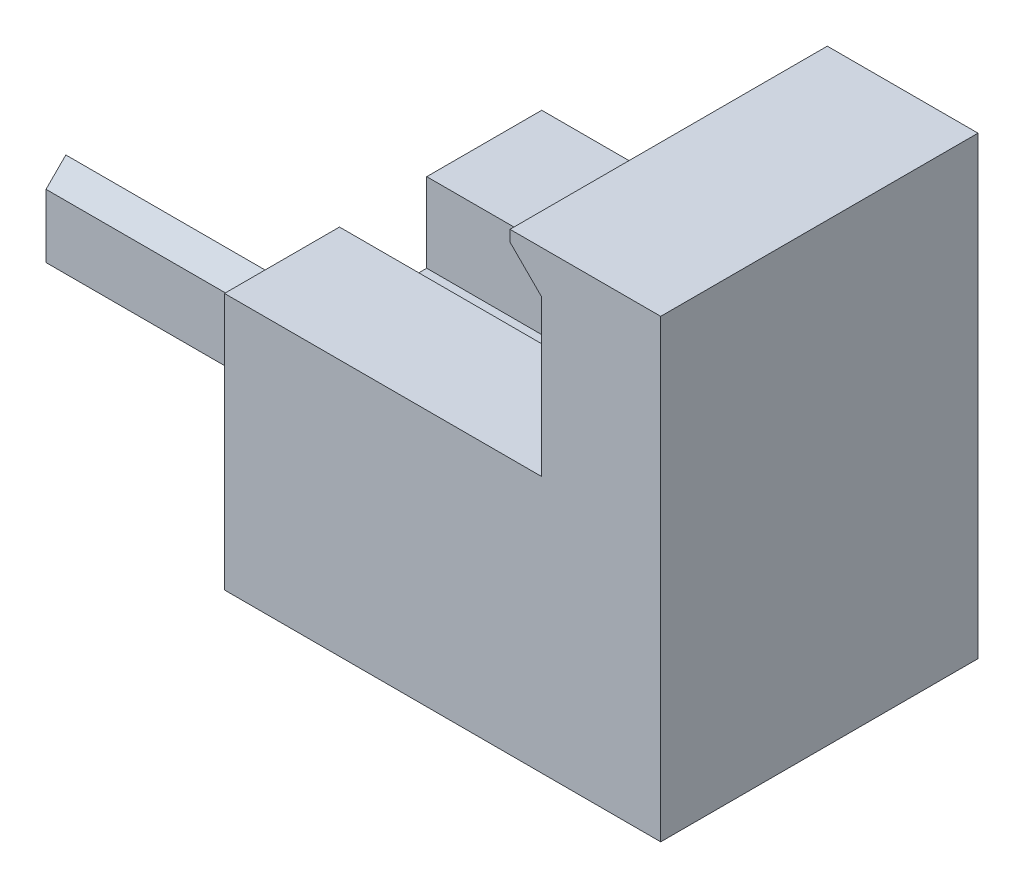
ISO-10303-21;
HEADER;
FILE_DESCRIPTION(('STEP AP214'),'2;1');
FILE_NAME('part.step','',(''),(''),'','','');
FILE_SCHEMA(('AUTOMOTIVE_DESIGN { 1 0 10303 214 1 1 1 1 }'));
ENDSEC;
DATA;
#1=APPLICATION_CONTEXT('core data for automotive mechanical design processes');
#2=APPLICATION_PROTOCOL_DEFINITION('international standard','automotive_design',2000,#1);
#3=PRODUCT_CONTEXT('',#1,'mechanical');
#4=PRODUCT('Part','Part','',(#3));
#5=PRODUCT_RELATED_PRODUCT_CATEGORY('part','',(#4));
#6=PRODUCT_DEFINITION_FORMATION('','',#4);
#7=PRODUCT_DEFINITION_CONTEXT('part definition',#1,'design');
#8=PRODUCT_DEFINITION('design','',#6,#7);
#9=PRODUCT_DEFINITION_SHAPE('','',#8);
#10=(LENGTH_UNIT() NAMED_UNIT(*) SI_UNIT(.MILLI.,.METRE.));
#11=(NAMED_UNIT(*) PLANE_ANGLE_UNIT() SI_UNIT($,.RADIAN.));
#12=(NAMED_UNIT(*) SI_UNIT($,.STERADIAN.) SOLID_ANGLE_UNIT());
#13=UNCERTAINTY_MEASURE_WITH_UNIT(LENGTH_MEASURE(1.E-05),#10,'distance_accuracy_value','');
#14=(GEOMETRIC_REPRESENTATION_CONTEXT(3) GLOBAL_UNCERTAINTY_ASSIGNED_CONTEXT((#13)) GLOBAL_UNIT_ASSIGNED_CONTEXT((#10,
#11,#12)) REPRESENTATION_CONTEXT('',''));
#15=CARTESIAN_POINT('',(0.,0.,0.));
#16=DIRECTION('',(0.,0.,1.));
#17=DIRECTION('',(1.,0.,0.));
#18=AXIS2_PLACEMENT_3D('',#15,#16,#17);
#19=CARTESIAN_POINT('',(20.,28.69,-20.));
#20=DIRECTION('',(1.,0.,0.));
#21=DIRECTION('',(0.,0.,-1.));
#22=AXIS2_PLACEMENT_3D('',#19,#20,#21);
#23=PLANE('',#22);
#24=DIRECTION('',(0.,0.,1.));
#25=VECTOR('',#24,1.);
#26=CARTESIAN_POINT('',(20.,25.99,-20.));
#27=LINE('',#26,#25);
#28=CARTESIAN_POINT('',(20.,25.99,-20.));
#29=VERTEX_POINT('',#28);
#30=CARTESIAN_POINT('',(20.,25.99,0.));
#31=VERTEX_POINT('',#30);
#32=EDGE_CURVE('E200',#29,#31,#27,.T.);
#33=ORIENTED_EDGE('',*,*,#32,.F.);
#34=DIRECTION('',(0.,-1.,0.));
#35=VECTOR('',#34,1.);
#36=CARTESIAN_POINT('',(20.,28.69,-20.));
#37=LINE('',#36,#35);
#38=CARTESIAN_POINT('',(20.,16.19,-20.));
#39=VERTEX_POINT('',#38);
#40=EDGE_CURVE('E316',#29,#39,#37,.T.);
#41=ORIENTED_EDGE('',*,*,#40,.T.);
#42=DIRECTION('',(0.,0.,1.));
#43=VECTOR('',#42,1.);
#44=CARTESIAN_POINT('',(20.,16.19,-20.));
#45=LINE('',#44,#43);
#46=CARTESIAN_POINT('',(20.,16.19,0.));
#47=VERTEX_POINT('',#46);
#48=EDGE_CURVE('E305',#39,#47,#45,.T.);
#49=ORIENTED_EDGE('',*,*,#48,.T.);
#50=DIRECTION('',(0.,-1.,0.));
#51=VECTOR('',#50,1.);
#52=CARTESIAN_POINT('',(20.,28.69,0.));
#53=LINE('',#52,#51);
#54=EDGE_CURVE('E187',#31,#47,#53,.T.);
#55=ORIENTED_EDGE('',*,*,#54,.F.);
#56=EDGE_LOOP('',(#33,#41,#49,#55));
#57=FACE_BOUND('',#56,.T.);
#58=ADVANCED_FACE('F41',(#57),#23,.F.);
#59=CARTESIAN_POINT('',(0.,16.19,0.));
#60=DIRECTION('',(1.,0.,0.));
#61=DIRECTION('',(0.,0.,-1.));
#62=AXIS2_PLACEMENT_3D('',#59,#60,#61);
#63=PLANE('',#62);
#64=DIRECTION('',(0.,0.,1.));
#65=VECTOR('',#64,1.);
#66=CARTESIAN_POINT('',(0.,16.19,0.));
#67=LINE('',#66,#65);
#68=CARTESIAN_POINT('',(0.,16.19,-7.25));
#69=VERTEX_POINT('',#68);
#70=CARTESIAN_POINT('',(0.,16.19,0.));
#71=VERTEX_POINT('',#70);
#72=EDGE_CURVE('E325',#69,#71,#67,.T.);
#73=ORIENTED_EDGE('',*,*,#72,.F.);
#74=DIRECTION('',(0.,1.,0.));
#75=VECTOR('',#74,1.);
#76=CARTESIAN_POINT('',(0.,11.19,-7.25));
#77=LINE('',#76,#75);
#78=CARTESIAN_POINT('',(0.,11.19,-7.25));
#79=VERTEX_POINT('',#78);
#80=EDGE_CURVE('E229',#79,#69,#77,.T.);
#81=ORIENTED_EDGE('',*,*,#80,.F.);
#82=DIRECTION('',(0.,0.,1.));
#83=VECTOR('',#82,1.);
#84=CARTESIAN_POINT('',(0.,11.19,-12.75));
#85=LINE('',#84,#83);
#86=CARTESIAN_POINT('',(0.,11.19,-12.75));
#87=VERTEX_POINT('',#86);
#88=EDGE_CURVE('E212',#87,#79,#85,.T.);
#89=ORIENTED_EDGE('',*,*,#88,.F.);
#90=DIRECTION('',(0.,1.,0.));
#91=VECTOR('',#90,1.);
#92=CARTESIAN_POINT('',(0.,11.19,-12.75));
#93=LINE('',#92,#91);
#94=CARTESIAN_POINT('',(0.,16.19,-12.75));
#95=VERTEX_POINT('',#94);
#96=EDGE_CURVE('E232',#87,#95,#93,.T.);
#97=ORIENTED_EDGE('',*,*,#96,.T.);
#98=CARTESIAN_POINT('',(0.,16.19,-20.));
#99=VERTEX_POINT('',#98);
#100=EDGE_CURVE('E320',#99,#95,#67,.T.);
#101=ORIENTED_EDGE('',*,*,#100,.F.);
#102=DIRECTION('',(0.,-1.,0.));
#103=VECTOR('',#102,1.);
#104=CARTESIAN_POINT('',(0.,16.19,-20.));
#105=LINE('',#104,#103);
#106=CARTESIAN_POINT('',(0.,0.,-20.));
#107=VERTEX_POINT('',#106);
#108=EDGE_CURVE('E332',#99,#107,#105,.T.);
#109=ORIENTED_EDGE('',*,*,#108,.T.);
#110=DIRECTION('',(0.,0.,1.));
#111=VECTOR('',#110,1.);
#112=CARTESIAN_POINT('',(0.,0.,0.));
#113=LINE('',#112,#111);
#114=CARTESIAN_POINT('',(0.,0.,0.));
#115=VERTEX_POINT('',#114);
#116=EDGE_CURVE('E319',#107,#115,#113,.T.);
#117=ORIENTED_EDGE('',*,*,#116,.T.);
#118=DIRECTION('',(0.,-1.,0.));
#119=VECTOR('',#118,1.);
#120=CARTESIAN_POINT('',(0.,16.19,0.));
#121=LINE('',#120,#119);
#122=EDGE_CURVE('E354',#71,#115,#121,.T.);
#123=ORIENTED_EDGE('',*,*,#122,.F.);
#124=EDGE_LOOP('',(#73,#81,#89,#97,#101,#109,#117,#123));
#125=FACE_BOUND('',#124,.T.);
#126=DIRECTION('',(0.,0.707106781186548,-0.707106781186547));
#127=VECTOR('',#126,1.);
#128=CARTESIAN_POINT('',(0.,8.75,-10.));
#129=LINE('',#128,#127);
#130=CARTESIAN_POINT('',(0.,7.5,-8.75));
#131=VERTEX_POINT('',#130);
#132=CARTESIAN_POINT('',(0.,8.75,-10.));
#133=VERTEX_POINT('',#132);
#134=EDGE_CURVE('E228',#131,#133,#129,.T.);
#135=ORIENTED_EDGE('',*,*,#134,.F.);
#136=DIRECTION('',(0.,1.,0.));
#137=VECTOR('',#136,1.);
#138=CARTESIAN_POINT('',(0.,7.5,-8.75));
#139=LINE('',#138,#137);
#140=CARTESIAN_POINT('',(0.,3.5,-8.75));
#141=VERTEX_POINT('',#140);
#142=EDGE_CURVE('E244',#141,#131,#139,.T.);
#143=ORIENTED_EDGE('',*,*,#142,.F.);
#144=DIRECTION('',(0.,0.707106781186548,0.707106781186547));
#145=VECTOR('',#144,1.);
#146=CARTESIAN_POINT('',(0.,3.5,-8.75));
#147=LINE('',#146,#145);
#148=CARTESIAN_POINT('',(0.,2.25,-9.99999999999999));
#149=VERTEX_POINT('',#148);
#150=EDGE_CURVE('E275',#149,#141,#147,.T.);
#151=ORIENTED_EDGE('',*,*,#150,.F.);
#152=DIRECTION('',(0.,-0.707106781186547,0.707106781186548));
#153=VECTOR('',#152,1.);
#154=CARTESIAN_POINT('',(0.,2.25,-10.));
#155=LINE('',#154,#153);
#156=CARTESIAN_POINT('',(0.,3.5,-11.25));
#157=VERTEX_POINT('',#156);
#158=EDGE_CURVE('E271',#157,#149,#155,.T.);
#159=ORIENTED_EDGE('',*,*,#158,.F.);
#160=DIRECTION('',(0.,-1.,0.));
#161=VECTOR('',#160,1.);
#162=CARTESIAN_POINT('',(0.,7.5,-11.25));
#163=LINE('',#162,#161);
#164=CARTESIAN_POINT('',(0.,7.5,-11.25));
#165=VERTEX_POINT('',#164);
#166=EDGE_CURVE('E267',#165,#157,#163,.T.);
#167=ORIENTED_EDGE('',*,*,#166,.F.);
#168=DIRECTION('',(0.,-0.707106781186547,-0.707106781186548));
#169=VECTOR('',#168,1.);
#170=CARTESIAN_POINT('',(0.,7.5,-11.25));
#171=LINE('',#170,#169);
#172=EDGE_CURVE('E263',#133,#165,#171,.T.);
#173=ORIENTED_EDGE('',*,*,#172,.F.);
#174=EDGE_LOOP('',(#135,#143,#151,#159,#167,#173));
#175=FACE_BOUND('',#174,.T.);
#176=ADVANCED_FACE('F379',(#125,#175),#63,.F.);
#177=CARTESIAN_POINT('',(0.,16.19,0.));
#178=DIRECTION('',(0.,-1.,0.));
#179=DIRECTION('',(0.,0.,-1.));
#180=AXIS2_PLACEMENT_3D('',#177,#178,#179);
#181=PLANE('',#180);
#182=DIRECTION('',(0.,0.,-1.));
#183=VECTOR('',#182,1.);
#184=CARTESIAN_POINT('',(15.,16.19,-12.75));
#185=LINE('',#184,#183);
#186=CARTESIAN_POINT('',(15.,16.19,-7.25));
#187=VERTEX_POINT('',#186);
#188=CARTESIAN_POINT('',(15.,16.19,-12.75));
#189=VERTEX_POINT('',#188);
#190=EDGE_CURVE('E193',#187,#189,#185,.T.);
#191=ORIENTED_EDGE('',*,*,#190,.F.);
#192=DIRECTION('',(1.,0.,0.));
#193=VECTOR('',#192,1.);
#194=CARTESIAN_POINT('',(15.,16.19,-7.25));
#195=LINE('',#194,#193);
#196=EDGE_CURVE('E208',#69,#187,#195,.T.);
#197=ORIENTED_EDGE('',*,*,#196,.F.);
#198=ORIENTED_EDGE('',*,*,#72,.T.);
#199=DIRECTION('',(1.,0.,0.));
#200=VECTOR('',#199,1.);
#201=CARTESIAN_POINT('',(0.,16.19,0.));
#202=LINE('',#201,#200);
#203=EDGE_CURVE('E324',#71,#47,#202,.T.);
#204=ORIENTED_EDGE('',*,*,#203,.T.);
#205=ORIENTED_EDGE('',*,*,#48,.F.);
#206=DIRECTION('',(-1.,0.,0.));
#207=VECTOR('',#206,1.);
#208=CARTESIAN_POINT('',(0.,16.19,-20.));
#209=LINE('',#208,#207);
#210=EDGE_CURVE('E329',#39,#99,#209,.T.);
#211=ORIENTED_EDGE('',*,*,#210,.T.);
#212=ORIENTED_EDGE('',*,*,#100,.T.);
#213=DIRECTION('',(-1.,0.,0.));
#214=VECTOR('',#213,1.);
#215=CARTESIAN_POINT('',(15.,16.19,-12.75));
#216=LINE('',#215,#214);
#217=EDGE_CURVE('E196',#189,#95,#216,.T.);
#218=ORIENTED_EDGE('',*,*,#217,.F.);
#219=EDGE_LOOP('',(#191,#197,#198,#204,#205,#211,#212,#218));
#220=FACE_BOUND('',#219,.T.);
#221=ADVANCED_FACE('F386',(#220),#181,.F.);
#222=CARTESIAN_POINT('',(0.,16.19,0.));
#223=DIRECTION('',(0.,0.,-1.));
#224=DIRECTION('',(-1.,0.,0.));
#225=AXIS2_PLACEMENT_3D('',#222,#223,#224);
#226=PLANE('',#225);
#227=DIRECTION('',(0.,1.,0.));
#228=VECTOR('',#227,1.);
#229=CARTESIAN_POINT('',(18.,28.69,0.));
#230=LINE('',#229,#228);
#231=CARTESIAN_POINT('',(18.,27.99,0.));
#232=VERTEX_POINT('',#231);
#233=CARTESIAN_POINT('',(18.,28.69,0.));
#234=VERTEX_POINT('',#233);
#235=EDGE_CURVE('E168',#232,#234,#230,.T.);
#236=ORIENTED_EDGE('',*,*,#235,.F.);
#237=DIRECTION('',(0.707106781186549,-0.707106781186546,0.));
#238=VECTOR('',#237,1.);
#239=CARTESIAN_POINT('',(18.,27.99,0.));
#240=LINE('',#239,#238);
#241=EDGE_CURVE('E51',#232,#31,#240,.T.);
#242=ORIENTED_EDGE('',*,*,#241,.T.);
#243=ORIENTED_EDGE('',*,*,#54,.T.);
#244=ORIENTED_EDGE('',*,*,#203,.F.);
#245=ORIENTED_EDGE('',*,*,#122,.T.);
#246=DIRECTION('',(1.,0.,0.));
#247=VECTOR('',#246,1.);
#248=CARTESIAN_POINT('',(0.,0.,0.));
#249=LINE('',#248,#247);
#250=CARTESIAN_POINT('',(27.5,0.,0.));
#251=VERTEX_POINT('',#250);
#252=EDGE_CURVE('E336',#115,#251,#249,.T.);
#253=ORIENTED_EDGE('',*,*,#252,.T.);
#254=DIRECTION('',(0.,-1.,0.));
#255=VECTOR('',#254,1.);
#256=CARTESIAN_POINT('',(27.5,16.19,0.));
#257=LINE('',#256,#255);
#258=CARTESIAN_POINT('',(27.5,28.69,0.));
#259=VERTEX_POINT('',#258);
#260=EDGE_CURVE('E182',#259,#251,#257,.T.);
#261=ORIENTED_EDGE('',*,*,#260,.F.);
#262=DIRECTION('',(1.,0.,0.));
#263=VECTOR('',#262,1.);
#264=CARTESIAN_POINT('',(27.5,28.69,0.));
#265=LINE('',#264,#263);
#266=EDGE_CURVE('E179',#234,#259,#265,.T.);
#267=ORIENTED_EDGE('',*,*,#266,.F.);
#268=EDGE_LOOP('',(#236,#242,#243,#244,#245,#253,#261,#267));
#269=FACE_BOUND('',#268,.T.);
#270=ADVANCED_FACE('F180',(#269),#226,.F.);
#271=CARTESIAN_POINT('',(27.5,16.19,0.));
#272=DIRECTION('',(-1.,0.,0.));
#273=DIRECTION('',(0.,0.,1.));
#274=AXIS2_PLACEMENT_3D('',#271,#272,#273);
#275=PLANE('',#274);
#276=DIRECTION('',(0.,0.,-1.));
#277=VECTOR('',#276,1.);
#278=CARTESIAN_POINT('',(27.5,0.,0.));
#279=LINE('',#278,#277);
#280=CARTESIAN_POINT('',(27.5,0.,-20.));
#281=VERTEX_POINT('',#280);
#282=EDGE_CURVE('E339',#251,#281,#279,.T.);
#283=ORIENTED_EDGE('',*,*,#282,.T.);
#284=DIRECTION('',(0.,-1.,0.));
#285=VECTOR('',#284,1.);
#286=CARTESIAN_POINT('',(27.5,16.19,-20.));
#287=LINE('',#286,#285);
#288=CARTESIAN_POINT('',(27.5,28.69,-20.));
#289=VERTEX_POINT('',#288);
#290=EDGE_CURVE('E348',#289,#281,#287,.T.);
#291=ORIENTED_EDGE('',*,*,#290,.F.);
#292=DIRECTION('',(0.,0.,-1.));
#293=VECTOR('',#292,1.);
#294=CARTESIAN_POINT('',(27.5,28.69,-20.));
#295=LINE('',#294,#293);
#296=EDGE_CURVE('E306',#259,#289,#295,.T.);
#297=ORIENTED_EDGE('',*,*,#296,.F.);
#298=ORIENTED_EDGE('',*,*,#260,.T.);
#299=EDGE_LOOP('',(#283,#291,#297,#298));
#300=FACE_BOUND('',#299,.T.);
#301=ADVANCED_FACE('F401',(#300),#275,.F.);
#302=CARTESIAN_POINT('',(0.,16.19,-20.));
#303=DIRECTION('',(0.,0.,1.));
#304=DIRECTION('',(1.,0.,0.));
#305=AXIS2_PLACEMENT_3D('',#302,#303,#304);
#306=PLANE('',#305);
#307=ORIENTED_EDGE('',*,*,#40,.F.);
#308=DIRECTION('',(-0.707106781186549,0.707106781186546,0.));
#309=VECTOR('',#308,1.);
#310=CARTESIAN_POINT('',(18.,27.99,-20.));
#311=LINE('',#310,#309);
#312=CARTESIAN_POINT('',(18.,27.99,-20.));
#313=VERTEX_POINT('',#312);
#314=EDGE_CURVE('E11',#29,#313,#311,.T.);
#315=ORIENTED_EDGE('',*,*,#314,.T.);
#316=DIRECTION('',(0.,-1.,0.));
#317=VECTOR('',#316,1.);
#318=CARTESIAN_POINT('',(18.,28.69,-20.));
#319=LINE('',#318,#317);
#320=CARTESIAN_POINT('',(18.,28.69,-20.));
#321=VERTEX_POINT('',#320);
#322=EDGE_CURVE('E176',#321,#313,#319,.T.);
#323=ORIENTED_EDGE('',*,*,#322,.F.);
#324=DIRECTION('',(-1.,0.,0.));
#325=VECTOR('',#324,1.);
#326=CARTESIAN_POINT('',(27.5,28.69,-20.));
#327=LINE('',#326,#325);
#328=EDGE_CURVE('E188',#289,#321,#327,.T.);
#329=ORIENTED_EDGE('',*,*,#328,.F.);
#330=ORIENTED_EDGE('',*,*,#290,.T.);
#331=DIRECTION('',(-1.,0.,0.));
#332=VECTOR('',#331,1.);
#333=CARTESIAN_POINT('',(0.,0.,-20.));
#334=LINE('',#333,#332);
#335=EDGE_CURVE('E342',#281,#107,#334,.T.);
#336=ORIENTED_EDGE('',*,*,#335,.T.);
#337=ORIENTED_EDGE('',*,*,#108,.F.);
#338=ORIENTED_EDGE('',*,*,#210,.F.);
#339=EDGE_LOOP('',(#307,#315,#323,#329,#330,#336,#337,#338));
#340=FACE_BOUND('',#339,.T.);
#341=ADVANCED_FACE('F397',(#340),#306,.F.);
#342=CARTESIAN_POINT('',(0.,0.,0.));
#343=DIRECTION('',(0.,-1.,0.));
#344=DIRECTION('',(0.,0.,-1.));
#345=AXIS2_PLACEMENT_3D('',#342,#343,#344);
#346=PLANE('',#345);
#347=ORIENTED_EDGE('',*,*,#116,.F.);
#348=ORIENTED_EDGE('',*,*,#335,.F.);
#349=ORIENTED_EDGE('',*,*,#282,.F.);
#350=ORIENTED_EDGE('',*,*,#252,.F.);
#351=EDGE_LOOP('',(#347,#348,#349,#350));
#352=FACE_BOUND('',#351,.T.);
#353=ADVANCED_FACE('F394',(#352),#346,.T.);
#354=CARTESIAN_POINT('',(0.,28.69,0.));
#355=DIRECTION('',(0.,-1.,0.));
#356=DIRECTION('',(0.,0.,-1.));
#357=AXIS2_PLACEMENT_3D('',#354,#355,#356);
#358=PLANE('',#357);
#359=ORIENTED_EDGE('',*,*,#296,.T.);
#360=ORIENTED_EDGE('',*,*,#328,.T.);
#361=DIRECTION('',(0.,0.,-1.));
#362=VECTOR('',#361,1.);
#363=CARTESIAN_POINT('',(18.,28.69,-20.));
#364=LINE('',#363,#362);
#365=EDGE_CURVE('E172',#234,#321,#364,.T.);
#366=ORIENTED_EDGE('',*,*,#365,.F.);
#367=ORIENTED_EDGE('',*,*,#266,.T.);
#368=EDGE_LOOP('',(#359,#360,#366,#367));
#369=FACE_BOUND('',#368,.T.);
#370=ADVANCED_FACE('F190',(#369),#358,.F.);
#371=CARTESIAN_POINT('',(-20.,8.75,-9.99999999999999));
#372=DIRECTION('',(0.,-0.707106781186547,-0.707106781186548));
#373=DIRECTION('',(0.,0.707106781186548,-0.707106781186547));
#374=AXIS2_PLACEMENT_3D('',#371,#372,#373);
#375=PLANE('',#374);
#376=ORIENTED_EDGE('',*,*,#134,.T.);
#377=DIRECTION('',(1.,0.,0.));
#378=VECTOR('',#377,1.);
#379=CARTESIAN_POINT('',(-20.,8.75,-9.99999999999999));
#380=LINE('',#379,#378);
#381=CARTESIAN_POINT('',(-20.,8.75,-9.99999999999999));
#382=VERTEX_POINT('',#381);
#383=EDGE_CURVE('E301',#382,#133,#380,.T.);
#384=ORIENTED_EDGE('',*,*,#383,.F.);
#385=DIRECTION('',(0.,0.707106781186548,-0.707106781186547));
#386=VECTOR('',#385,1.);
#387=CARTESIAN_POINT('',(-20.,8.75,-9.99999999999999));
#388=LINE('',#387,#386);
#389=CARTESIAN_POINT('',(-20.,7.5,-8.75));
#390=VERTEX_POINT('',#389);
#391=EDGE_CURVE('E239',#390,#382,#388,.T.);
#392=ORIENTED_EDGE('',*,*,#391,.F.);
#393=DIRECTION('',(1.,0.,0.));
#394=VECTOR('',#393,1.);
#395=CARTESIAN_POINT('',(-20.,7.5,-8.75));
#396=LINE('',#395,#394);
#397=EDGE_CURVE('E259',#390,#131,#396,.T.);
#398=ORIENTED_EDGE('',*,*,#397,.T.);
#399=EDGE_LOOP('',(#376,#384,#392,#398));
#400=FACE_BOUND('',#399,.T.);
#401=ADVANCED_FACE('F419',(#400),#375,.F.);
#402=CARTESIAN_POINT('',(-20.,7.5,-11.25));
#403=DIRECTION('',(0.,-0.707106781186548,0.707106781186547));
#404=DIRECTION('',(0.,-0.707106781186547,-0.707106781186548));
#405=AXIS2_PLACEMENT_3D('',#402,#403,#404);
#406=PLANE('',#405);
#407=ORIENTED_EDGE('',*,*,#172,.T.);
#408=DIRECTION('',(1.,0.,0.));
#409=VECTOR('',#408,1.);
#410=CARTESIAN_POINT('',(-20.,7.5,-11.25));
#411=LINE('',#410,#409);
#412=CARTESIAN_POINT('',(-20.,7.5,-11.25));
#413=VERTEX_POINT('',#412);
#414=EDGE_CURVE('E297',#413,#165,#411,.T.);
#415=ORIENTED_EDGE('',*,*,#414,.F.);
#416=DIRECTION('',(0.,-0.707106781186547,-0.707106781186548));
#417=VECTOR('',#416,1.);
#418=CARTESIAN_POINT('',(-20.,7.5,-11.25));
#419=LINE('',#418,#417);
#420=EDGE_CURVE('E243',#382,#413,#419,.T.);
#421=ORIENTED_EDGE('',*,*,#420,.F.);
#422=ORIENTED_EDGE('',*,*,#383,.T.);
#423=EDGE_LOOP('',(#407,#415,#421,#422));
#424=FACE_BOUND('',#423,.T.);
#425=ADVANCED_FACE('F541',(#424),#406,.F.);
#426=CARTESIAN_POINT('',(-20.,7.5,-11.25));
#427=DIRECTION('',(0.,0.,1.));
#428=DIRECTION('',(1.,0.,0.));
#429=AXIS2_PLACEMENT_3D('',#426,#427,#428);
#430=PLANE('',#429);
#431=ORIENTED_EDGE('',*,*,#166,.T.);
#432=DIRECTION('',(1.,0.,0.));
#433=VECTOR('',#432,1.);
#434=CARTESIAN_POINT('',(-20.,3.5,-11.25));
#435=LINE('',#434,#433);
#436=CARTESIAN_POINT('',(-20.,3.5,-11.25));
#437=VERTEX_POINT('',#436);
#438=EDGE_CURVE('E293',#437,#157,#435,.T.);
#439=ORIENTED_EDGE('',*,*,#438,.F.);
#440=DIRECTION('',(0.,-1.,0.));
#441=VECTOR('',#440,1.);
#442=CARTESIAN_POINT('',(-20.,7.5,-11.25));
#443=LINE('',#442,#441);
#444=EDGE_CURVE('E247',#413,#437,#443,.T.);
#445=ORIENTED_EDGE('',*,*,#444,.F.);
#446=ORIENTED_EDGE('',*,*,#414,.T.);
#447=EDGE_LOOP('',(#431,#439,#445,#446));
#448=FACE_BOUND('',#447,.T.);
#449=ADVANCED_FACE('F532',(#448),#430,.F.);
#450=CARTESIAN_POINT('',(-20.,2.25,-9.99999999999999));
#451=DIRECTION('',(0.,0.707106781186548,0.707106781186547));
#452=DIRECTION('',(0.,-0.707106781186547,0.707106781186548));
#453=AXIS2_PLACEMENT_3D('',#450,#451,#452);
#454=PLANE('',#453);
#455=ORIENTED_EDGE('',*,*,#158,.T.);
#456=DIRECTION('',(1.,0.,0.));
#457=VECTOR('',#456,1.);
#458=CARTESIAN_POINT('',(-20.,2.25,-9.99999999999999));
#459=LINE('',#458,#457);
#460=CARTESIAN_POINT('',(-20.,2.25,-9.99999999999999));
#461=VERTEX_POINT('',#460);
#462=EDGE_CURVE('E289',#461,#149,#459,.T.);
#463=ORIENTED_EDGE('',*,*,#462,.F.);
#464=DIRECTION('',(0.,-0.707106781186547,0.707106781186548));
#465=VECTOR('',#464,1.);
#466=CARTESIAN_POINT('',(-20.,2.25,-9.99999999999999));
#467=LINE('',#466,#465);
#468=EDGE_CURVE('E250',#437,#461,#467,.T.);
#469=ORIENTED_EDGE('',*,*,#468,.F.);
#470=ORIENTED_EDGE('',*,*,#438,.T.);
#471=EDGE_LOOP('',(#455,#463,#469,#470));
#472=FACE_BOUND('',#471,.T.);
#473=ADVANCED_FACE('F523',(#472),#454,.F.);
#474=CARTESIAN_POINT('',(-20.,3.5,-8.75));
#475=DIRECTION('',(0.,0.707106781186547,-0.707106781186548));
#476=DIRECTION('',(0.,0.707106781186548,0.707106781186547));
#477=AXIS2_PLACEMENT_3D('',#474,#475,#476);
#478=PLANE('',#477);
#479=ORIENTED_EDGE('',*,*,#150,.T.);
#480=DIRECTION('',(1.,0.,0.));
#481=VECTOR('',#480,1.);
#482=CARTESIAN_POINT('',(-20.,3.5,-8.75));
#483=LINE('',#482,#481);
#484=CARTESIAN_POINT('',(-20.,3.5,-8.75));
#485=VERTEX_POINT('',#484);
#486=EDGE_CURVE('E285',#485,#141,#483,.T.);
#487=ORIENTED_EDGE('',*,*,#486,.F.);
#488=DIRECTION('',(0.,0.707106781186548,0.707106781186547));
#489=VECTOR('',#488,1.);
#490=CARTESIAN_POINT('',(-20.,3.5,-8.75));
#491=LINE('',#490,#489);
#492=EDGE_CURVE('E253',#461,#485,#491,.T.);
#493=ORIENTED_EDGE('',*,*,#492,.F.);
#494=ORIENTED_EDGE('',*,*,#462,.T.);
#495=EDGE_LOOP('',(#479,#487,#493,#494));
#496=FACE_BOUND('',#495,.T.);
#497=ADVANCED_FACE('F514',(#496),#478,.F.);
#498=CARTESIAN_POINT('',(-20.,7.5,-8.75));
#499=DIRECTION('',(0.,0.,-1.));
#500=DIRECTION('',(-1.,0.,0.));
#501=AXIS2_PLACEMENT_3D('',#498,#499,#500);
#502=PLANE('',#501);
#503=ORIENTED_EDGE('',*,*,#142,.T.);
#504=ORIENTED_EDGE('',*,*,#397,.F.);
#505=DIRECTION('',(0.,1.,0.));
#506=VECTOR('',#505,1.);
#507=CARTESIAN_POINT('',(-20.,7.5,-8.75));
#508=LINE('',#507,#506);
#509=EDGE_CURVE('E256',#485,#390,#508,.T.);
#510=ORIENTED_EDGE('',*,*,#509,.F.);
#511=ORIENTED_EDGE('',*,*,#486,.T.);
#512=EDGE_LOOP('',(#503,#504,#510,#511));
#513=FACE_BOUND('',#512,.T.);
#514=ADVANCED_FACE('F504',(#513),#502,.F.);
#515=CARTESIAN_POINT('',(-20.,0.,0.));
#516=DIRECTION('',(1.,0.,0.));
#517=DIRECTION('',(0.,0.,-1.));
#518=AXIS2_PLACEMENT_3D('',#515,#516,#517);
#519=PLANE('',#518);
#520=ORIENTED_EDGE('',*,*,#391,.T.);
#521=ORIENTED_EDGE('',*,*,#420,.T.);
#522=ORIENTED_EDGE('',*,*,#444,.T.);
#523=ORIENTED_EDGE('',*,*,#468,.T.);
#524=ORIENTED_EDGE('',*,*,#492,.T.);
#525=ORIENTED_EDGE('',*,*,#509,.T.);
#526=EDGE_LOOP('',(#520,#521,#522,#523,#524,#525));
#527=FACE_BOUND('',#526,.T.);
#528=ADVANCED_FACE('F494',(#527),#519,.F.);
#529=CARTESIAN_POINT('',(15.,11.19,-12.75));
#530=DIRECTION('',(1.,0.,0.));
#531=DIRECTION('',(0.,0.,-1.));
#532=AXIS2_PLACEMENT_3D('',#529,#530,#531);
#533=PLANE('',#532);
#534=ORIENTED_EDGE('',*,*,#190,.T.);
#535=DIRECTION('',(0.,1.,0.));
#536=VECTOR('',#535,1.);
#537=CARTESIAN_POINT('',(15.,11.19,-12.75));
#538=LINE('',#537,#536);
#539=CARTESIAN_POINT('',(15.,11.19,-12.75));
#540=VERTEX_POINT('',#539);
#541=EDGE_CURVE('E218',#540,#189,#538,.T.);
#542=ORIENTED_EDGE('',*,*,#541,.F.);
#543=DIRECTION('',(0.,0.,-1.));
#544=VECTOR('',#543,1.);
#545=CARTESIAN_POINT('',(15.,11.19,-12.75));
#546=LINE('',#545,#544);
#547=CARTESIAN_POINT('',(15.,11.19,-7.25));
#548=VERTEX_POINT('',#547);
#549=EDGE_CURVE('E203',#548,#540,#546,.T.);
#550=ORIENTED_EDGE('',*,*,#549,.F.);
#551=DIRECTION('',(0.,1.,0.));
#552=VECTOR('',#551,1.);
#553=CARTESIAN_POINT('',(15.,11.19,-7.25));
#554=LINE('',#553,#552);
#555=EDGE_CURVE('E225',#548,#187,#554,.T.);
#556=ORIENTED_EDGE('',*,*,#555,.T.);
#557=EDGE_LOOP('',(#534,#542,#550,#556));
#558=FACE_BOUND('',#557,.T.);
#559=ADVANCED_FACE('F486',(#558),#533,.F.);
#560=CARTESIAN_POINT('',(15.,11.19,-7.25));
#561=DIRECTION('',(0.,0.,1.));
#562=DIRECTION('',(1.,0.,0.));
#563=AXIS2_PLACEMENT_3D('',#560,#561,#562);
#564=PLANE('',#563);
#565=CARTESIAN_POINT('',(11.7750640499281,13.69,-7.25));
#566=DIRECTION('',(0.,0.,1.));
#567=DIRECTION('',(1.,0.,0.));
#568=AXIS2_PLACEMENT_3D('',#565,#566,#567);
#569=CIRCLE('',#568,1.);
#570=CARTESIAN_POINT('',(12.7750640499281,13.69,-7.25));
#571=VERTEX_POINT('',#570);
#572=EDGE_CURVE('E362',#571,#571,#569,.F.);
#573=ORIENTED_EDGE('',*,*,#572,.F.);
#574=EDGE_LOOP('',(#573));
#575=FACE_BOUND('',#574,.T.);
#576=ORIENTED_EDGE('',*,*,#196,.T.);
#577=ORIENTED_EDGE('',*,*,#555,.F.);
#578=DIRECTION('',(1.,0.,0.));
#579=VECTOR('',#578,1.);
#580=CARTESIAN_POINT('',(15.,11.19,-7.25));
#581=LINE('',#580,#579);
#582=EDGE_CURVE('E215',#79,#548,#581,.T.);
#583=ORIENTED_EDGE('',*,*,#582,.F.);
#584=ORIENTED_EDGE('',*,*,#80,.T.);
#585=EDGE_LOOP('',(#576,#577,#583,#584));
#586=FACE_BOUND('',#585,.T.);
#587=ADVANCED_FACE('F478',(#575,#586),#564,.F.);
#588=CARTESIAN_POINT('',(15.,11.19,-12.75));
#589=DIRECTION('',(0.,0.,-1.));
#590=DIRECTION('',(-1.,0.,0.));
#591=AXIS2_PLACEMENT_3D('',#588,#589,#590);
#592=PLANE('',#591);
#593=CARTESIAN_POINT('',(11.7750640499281,13.69,-12.75));
#594=DIRECTION('',(0.,0.,-1.));
#595=DIRECTION('',(-1.,0.,0.));
#596=AXIS2_PLACEMENT_3D('',#593,#594,#595);
#597=CIRCLE('',#596,1.);
#598=CARTESIAN_POINT('',(10.7750640499281,13.69,-12.75));
#599=VERTEX_POINT('',#598);
#600=EDGE_CURVE('E358',#599,#599,#597,.F.);
#601=ORIENTED_EDGE('',*,*,#600,.F.);
#602=EDGE_LOOP('',(#601));
#603=FACE_BOUND('',#602,.T.);
#604=ORIENTED_EDGE('',*,*,#217,.T.);
#605=ORIENTED_EDGE('',*,*,#96,.F.);
#606=DIRECTION('',(-1.,0.,0.));
#607=VECTOR('',#606,1.);
#608=CARTESIAN_POINT('',(15.,11.19,-12.75));
#609=LINE('',#608,#607);
#610=EDGE_CURVE('E207',#540,#87,#609,.T.);
#611=ORIENTED_EDGE('',*,*,#610,.F.);
#612=ORIENTED_EDGE('',*,*,#541,.T.);
#613=EDGE_LOOP('',(#604,#605,#611,#612));
#614=FACE_BOUND('',#613,.T.);
#615=ADVANCED_FACE('F468',(#603,#614),#592,.F.);
#616=CARTESIAN_POINT('',(0.,11.19,0.));
#617=DIRECTION('',(0.,-1.,0.));
#618=DIRECTION('',(0.,0.,-1.));
#619=AXIS2_PLACEMENT_3D('',#616,#617,#618);
#620=PLANE('',#619);
#621=ORIENTED_EDGE('',*,*,#549,.T.);
#622=ORIENTED_EDGE('',*,*,#610,.T.);
#623=ORIENTED_EDGE('',*,*,#88,.T.);
#624=ORIENTED_EDGE('',*,*,#582,.T.);
#625=EDGE_LOOP('',(#621,#622,#623,#624));
#626=FACE_BOUND('',#625,.T.);
#627=ADVANCED_FACE('F458',(#626),#620,.F.);
#628=CARTESIAN_POINT('',(11.7750640499281,13.69,-4.42157287525381));
#629=DIRECTION('',(0.,0.,-1.));
#630=DIRECTION('',(-1.,0.,0.));
#631=AXIS2_PLACEMENT_3D('',#628,#629,#630);
#632=CYLINDRICAL_SURFACE('',#631,1.);
#633=ORIENTED_EDGE('',*,*,#600,.T.);
#634=EDGE_LOOP('',(#633));
#635=FACE_BOUND('',#634,.T.);
#636=ORIENTED_EDGE('',*,*,#572,.T.);
#637=EDGE_LOOP('',(#636));
#638=FACE_BOUND('',#637,.T.);
#639=ADVANCED_FACE('F376',(#635,#638),#632,.T.);
#640=CARTESIAN_POINT('',(18.,0.,0.));
#641=DIRECTION('',(-1.,0.,0.));
#642=DIRECTION('',(0.,0.,1.));
#643=AXIS2_PLACEMENT_3D('',#640,#641,#642);
#644=PLANE('',#643);
#645=ORIENTED_EDGE('',*,*,#322,.T.);
#646=DIRECTION('',(0.,0.,1.));
#647=VECTOR('',#646,1.);
#648=CARTESIAN_POINT('',(18.,27.99,0.));
#649=LINE('',#648,#647);
#650=EDGE_CURVE('E173',#313,#232,#649,.T.);
#651=ORIENTED_EDGE('',*,*,#650,.T.);
#652=ORIENTED_EDGE('',*,*,#235,.T.);
#653=ORIENTED_EDGE('',*,*,#365,.T.);
#654=EDGE_LOOP('',(#645,#651,#652,#653));
#655=FACE_BOUND('',#654,.T.);
#656=ADVANCED_FACE('F170',(#655),#644,.T.);
#657=CARTESIAN_POINT('',(18.,27.99,0.));
#658=DIRECTION('',(-0.707106781186546,-0.707106781186549,0.));
#659=DIRECTION('',(0.,0.,-1.));
#660=AXIS2_PLACEMENT_3D('',#657,#658,#659);
#661=PLANE('',#660);
#662=ORIENTED_EDGE('',*,*,#314,.F.);
#663=ORIENTED_EDGE('',*,*,#32,.T.);
#664=ORIENTED_EDGE('',*,*,#241,.F.);
#665=ORIENTED_EDGE('',*,*,#650,.F.);
#666=EDGE_LOOP('',(#662,#663,#664,#665));
#667=FACE_BOUND('',#666,.T.);
#668=ADVANCED_FACE('F44',(#667),#661,.T.);
#669=CLOSED_SHELL('',(#58,#176,#221,#270,#301,#341,#353,#370,#401,#425,#449,#473,#497,#514,#528,
#559,#587,#615,#627,#639,#656,#668));
#670=MANIFOLD_SOLID_BREP('B2',#669);
#671=ADVANCED_BREP_SHAPE_REPRESENTATION('',(#18,#670),#14);
#672=SHAPE_DEFINITION_REPRESENTATION(#9,#671);
ENDSEC;
END-ISO-10303-21;
